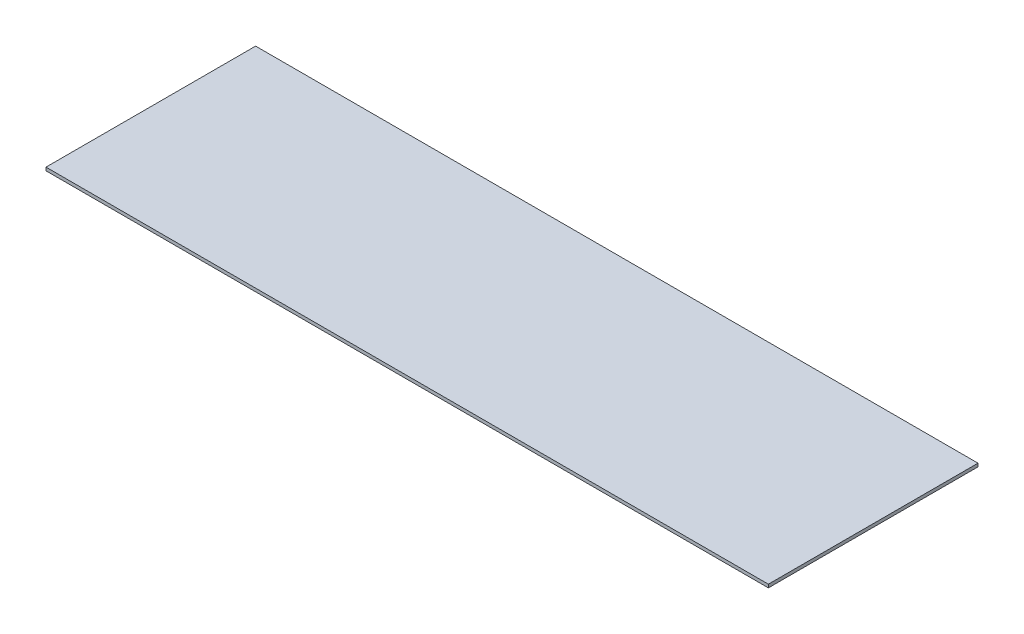
ISO-10303-21;
HEADER;
FILE_DESCRIPTION(('STEP AP214'),'2;1');
FILE_NAME('part.step','',(''),(''),'','','');
FILE_SCHEMA(('AUTOMOTIVE_DESIGN { 1 0 10303 214 1 1 1 1 }'));
ENDSEC;
DATA;
#1=APPLICATION_CONTEXT('core data for automotive mechanical design processes');
#2=APPLICATION_PROTOCOL_DEFINITION('international standard','automotive_design',2000,#1);
#3=PRODUCT_CONTEXT('',#1,'mechanical');
#4=PRODUCT('Part','Part','',(#3));
#5=PRODUCT_RELATED_PRODUCT_CATEGORY('part','',(#4));
#6=PRODUCT_DEFINITION_FORMATION('','',#4);
#7=PRODUCT_DEFINITION_CONTEXT('part definition',#1,'design');
#8=PRODUCT_DEFINITION('design','',#6,#7);
#9=PRODUCT_DEFINITION_SHAPE('','',#8);
#10=(LENGTH_UNIT() NAMED_UNIT(*) SI_UNIT(.MILLI.,.METRE.));
#11=(NAMED_UNIT(*) PLANE_ANGLE_UNIT() SI_UNIT($,.RADIAN.));
#12=(NAMED_UNIT(*) SI_UNIT($,.STERADIAN.) SOLID_ANGLE_UNIT());
#13=UNCERTAINTY_MEASURE_WITH_UNIT(LENGTH_MEASURE(1.E-05),#10,'distance_accuracy_value','');
#14=(GEOMETRIC_REPRESENTATION_CONTEXT(3) GLOBAL_UNCERTAINTY_ASSIGNED_CONTEXT((#13)) GLOBAL_UNIT_ASSIGNED_CONTEXT((#10,
#11,#12)) REPRESENTATION_CONTEXT('',''));
#15=CARTESIAN_POINT('',(0.,0.,0.));
#16=DIRECTION('',(0.,0.,1.));
#17=DIRECTION('',(1.,0.,0.));
#18=AXIS2_PLACEMENT_3D('',#15,#16,#17);
#19=CARTESIAN_POINT('',(355.6,1.5875,0.));
#20=DIRECTION('',(0.,-1.,0.));
#21=DIRECTION('',(0.,0.,-1.));
#22=AXIS2_PLACEMENT_3D('',#19,#20,#21);
#23=PLANE('',#22);
#24=DIRECTION('',(0.,0.,-1.));
#25=VECTOR('',#24,1.);
#26=CARTESIAN_POINT('',(0.,1.5875,0.));
#27=LINE('',#26,#25);
#28=CARTESIAN_POINT('',(0.,1.5875,0.));
#29=VERTEX_POINT('',#28);
#30=CARTESIAN_POINT('',(0.,1.5875,103.1875));
#31=VERTEX_POINT('',#30);
#32=EDGE_CURVE('E100',#29,#31,#27,.F.);
#33=ORIENTED_EDGE('',*,*,#32,.T.);
#34=DIRECTION('',(-1.,0.,0.));
#35=VECTOR('',#34,1.);
#36=CARTESIAN_POINT('',(355.6,1.5875,103.1875));
#37=LINE('',#36,#35);
#38=CARTESIAN_POINT('',(355.6,1.5875,103.1875));
#39=VERTEX_POINT('',#38);
#40=EDGE_CURVE('E11',#39,#31,#37,.T.);
#41=ORIENTED_EDGE('',*,*,#40,.F.);
#42=DIRECTION('',(0.,0.,-1.));
#43=VECTOR('',#42,1.);
#44=CARTESIAN_POINT('',(355.6,1.5875,0.));
#45=LINE('',#44,#43);
#46=CARTESIAN_POINT('',(355.6,1.5875,0.));
#47=VERTEX_POINT('',#46);
#48=EDGE_CURVE('E77',#47,#39,#45,.F.);
#49=ORIENTED_EDGE('',*,*,#48,.F.);
#50=DIRECTION('',(-1.,0.,0.));
#51=VECTOR('',#50,1.);
#52=CARTESIAN_POINT('',(355.6,1.5875,0.));
#53=LINE('',#52,#51);
#54=EDGE_CURVE('E53',#47,#29,#53,.T.);
#55=ORIENTED_EDGE('',*,*,#54,.T.);
#56=EDGE_LOOP('',(#33,#41,#49,#55));
#57=FACE_BOUND('',#56,.T.);
#58=ADVANCED_FACE('F37',(#57),#23,.F.);
#59=CARTESIAN_POINT('',(355.6,0.,103.1875));
#60=DIRECTION('',(0.,0.,1.));
#61=DIRECTION('',(1.,0.,0.));
#62=AXIS2_PLACEMENT_3D('',#59,#60,#61);
#63=PLANE('',#62);
#64=DIRECTION('',(0.,1.,0.));
#65=VECTOR('',#64,1.);
#66=CARTESIAN_POINT('',(0.,0.,103.1875));
#67=LINE('',#66,#65);
#68=CARTESIAN_POINT('',(0.,0.,103.1875));
#69=VERTEX_POINT('',#68);
#70=EDGE_CURVE('E86',#69,#31,#67,.T.);
#71=ORIENTED_EDGE('',*,*,#70,.F.);
#72=DIRECTION('',(-1.,0.,0.));
#73=VECTOR('',#72,1.);
#74=CARTESIAN_POINT('',(355.6,0.,103.1875));
#75=LINE('',#74,#73);
#76=CARTESIAN_POINT('',(355.6,0.,103.1875));
#77=VERTEX_POINT('',#76);
#78=EDGE_CURVE('E45',#77,#69,#75,.T.);
#79=ORIENTED_EDGE('',*,*,#78,.F.);
#80=DIRECTION('',(0.,1.,0.));
#81=VECTOR('',#80,1.);
#82=CARTESIAN_POINT('',(355.6,0.,103.1875));
#83=LINE('',#82,#81);
#84=EDGE_CURVE('E84',#77,#39,#83,.T.);
#85=ORIENTED_EDGE('',*,*,#84,.T.);
#86=ORIENTED_EDGE('',*,*,#40,.T.);
#87=EDGE_LOOP('',(#71,#79,#85,#86));
#88=FACE_BOUND('',#87,.T.);
#89=ADVANCED_FACE('F83',(#88),#63,.T.);
#90=CARTESIAN_POINT('',(355.6,0.,0.));
#91=DIRECTION('',(0.,-1.,0.));
#92=DIRECTION('',(0.,0.,-1.));
#93=AXIS2_PLACEMENT_3D('',#90,#91,#92);
#94=PLANE('',#93);
#95=DIRECTION('',(0.,0.,1.));
#96=VECTOR('',#95,1.);
#97=CARTESIAN_POINT('',(0.,0.,0.));
#98=LINE('',#97,#96);
#99=CARTESIAN_POINT('',(0.,0.,0.));
#100=VERTEX_POINT('',#99);
#101=EDGE_CURVE('E103',#100,#69,#98,.T.);
#102=ORIENTED_EDGE('',*,*,#101,.F.);
#103=DIRECTION('',(-1.,0.,0.));
#104=VECTOR('',#103,1.);
#105=CARTESIAN_POINT('',(355.6,0.,0.));
#106=LINE('',#105,#104);
#107=CARTESIAN_POINT('',(355.6,0.,0.));
#108=VERTEX_POINT('',#107);
#109=EDGE_CURVE('E66',#108,#100,#106,.T.);
#110=ORIENTED_EDGE('',*,*,#109,.F.);
#111=DIRECTION('',(0.,0.,1.));
#112=VECTOR('',#111,1.);
#113=CARTESIAN_POINT('',(355.6,0.,0.));
#114=LINE('',#113,#112);
#115=EDGE_CURVE('E92',#108,#77,#114,.T.);
#116=ORIENTED_EDGE('',*,*,#115,.T.);
#117=ORIENTED_EDGE('',*,*,#78,.T.);
#118=EDGE_LOOP('',(#102,#110,#116,#117));
#119=FACE_BOUND('',#118,.T.);
#120=ADVANCED_FACE('F94',(#119),#94,.T.);
#121=CARTESIAN_POINT('',(355.6,1.5875,0.));
#122=DIRECTION('',(0.,0.,-1.));
#123=DIRECTION('',(-1.,0.,0.));
#124=AXIS2_PLACEMENT_3D('',#121,#122,#123);
#125=PLANE('',#124);
#126=DIRECTION('',(0.,-1.,0.));
#127=VECTOR('',#126,1.);
#128=CARTESIAN_POINT('',(0.,1.5875,0.));
#129=LINE('',#128,#127);
#130=EDGE_CURVE('E105',#29,#100,#129,.T.);
#131=ORIENTED_EDGE('',*,*,#130,.F.);
#132=ORIENTED_EDGE('',*,*,#54,.F.);
#133=DIRECTION('',(0.,-1.,0.));
#134=VECTOR('',#133,1.);
#135=CARTESIAN_POINT('',(355.6,1.5875,0.));
#136=LINE('',#135,#134);
#137=EDGE_CURVE('E95',#47,#108,#136,.T.);
#138=ORIENTED_EDGE('',*,*,#137,.T.);
#139=ORIENTED_EDGE('',*,*,#109,.T.);
#140=EDGE_LOOP('',(#131,#132,#138,#139));
#141=FACE_BOUND('',#140,.T.);
#142=ADVANCED_FACE('F111',(#141),#125,.T.);
#143=CARTESIAN_POINT('',(355.6,0.,0.));
#144=DIRECTION('',(1.,0.,0.));
#145=DIRECTION('',(0.,0.,-1.));
#146=AXIS2_PLACEMENT_3D('',#143,#144,#145);
#147=PLANE('',#146);
#148=ORIENTED_EDGE('',*,*,#48,.T.);
#149=ORIENTED_EDGE('',*,*,#84,.F.);
#150=ORIENTED_EDGE('',*,*,#115,.F.);
#151=ORIENTED_EDGE('',*,*,#137,.F.);
#152=EDGE_LOOP('',(#148,#149,#150,#151));
#153=FACE_BOUND('',#152,.T.);
#154=ADVANCED_FACE('F91',(#153),#147,.T.);
#155=CARTESIAN_POINT('',(0.,0.,0.));
#156=DIRECTION('',(1.,0.,0.));
#157=DIRECTION('',(0.,0.,-1.));
#158=AXIS2_PLACEMENT_3D('',#155,#156,#157);
#159=PLANE('',#158);
#160=ORIENTED_EDGE('',*,*,#32,.F.);
#161=ORIENTED_EDGE('',*,*,#130,.T.);
#162=ORIENTED_EDGE('',*,*,#101,.T.);
#163=ORIENTED_EDGE('',*,*,#70,.T.);
#164=EDGE_LOOP('',(#160,#161,#162,#163));
#165=FACE_BOUND('',#164,.T.);
#166=ADVANCED_FACE('F110',(#165),#159,.F.);
#167=CLOSED_SHELL('',(#58,#89,#120,#142,#154,#166));
#168=MANIFOLD_SOLID_BREP('B2',#167);
#169=ADVANCED_BREP_SHAPE_REPRESENTATION('',(#18,#168),#14);
#170=SHAPE_DEFINITION_REPRESENTATION(#9,#169);
ENDSEC;
END-ISO-10303-21;
